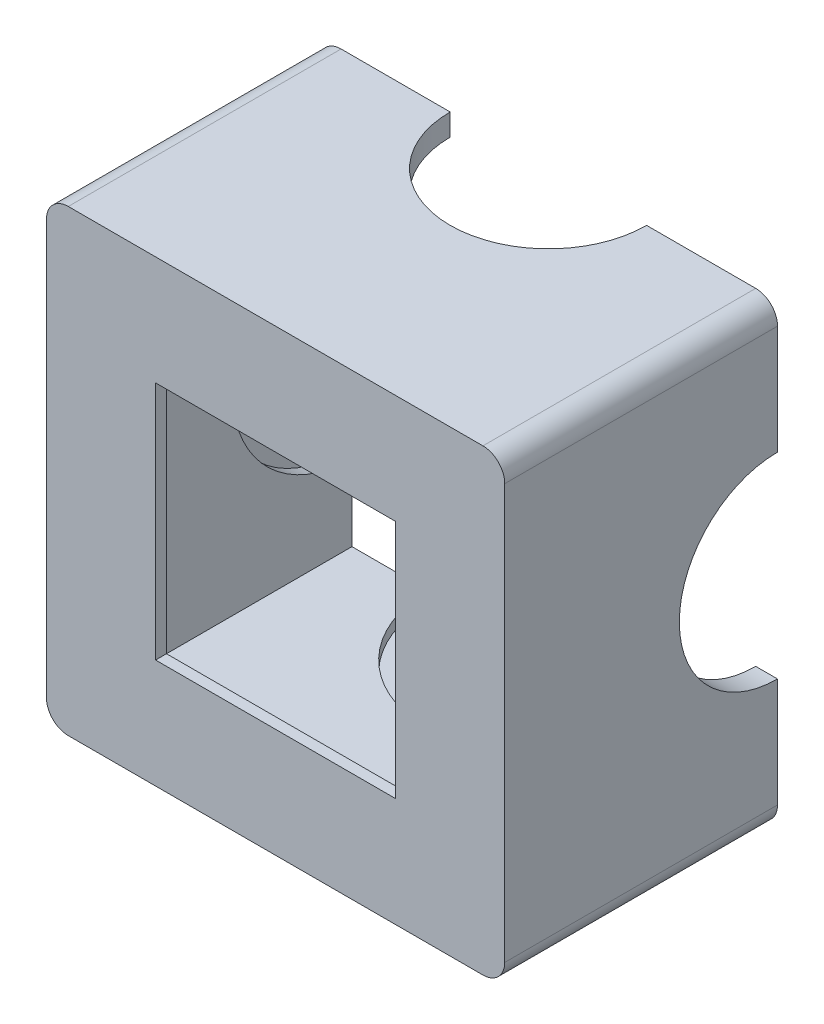
ISO-10303-21;
HEADER;
FILE_DESCRIPTION(('STEP AP214'),'2;1');
FILE_NAME('part.step','',(''),(''),'','','');
FILE_SCHEMA(('AUTOMOTIVE_DESIGN { 1 0 10303 214 1 1 1 1 }'));
ENDSEC;
DATA;
#1=APPLICATION_CONTEXT('core data for automotive mechanical design processes');
#2=APPLICATION_PROTOCOL_DEFINITION('international standard','automotive_design',2000,#1);
#3=PRODUCT_CONTEXT('',#1,'mechanical');
#4=PRODUCT('Part','Part','',(#3));
#5=PRODUCT_RELATED_PRODUCT_CATEGORY('part','',(#4));
#6=PRODUCT_DEFINITION_FORMATION('','',#4);
#7=PRODUCT_DEFINITION_CONTEXT('part definition',#1,'design');
#8=PRODUCT_DEFINITION('design','',#6,#7);
#9=PRODUCT_DEFINITION_SHAPE('','',#8);
#10=(LENGTH_UNIT() NAMED_UNIT(*) SI_UNIT(.MILLI.,.METRE.));
#11=(NAMED_UNIT(*) PLANE_ANGLE_UNIT() SI_UNIT($,.RADIAN.));
#12=(NAMED_UNIT(*) SI_UNIT($,.STERADIAN.) SOLID_ANGLE_UNIT());
#13=UNCERTAINTY_MEASURE_WITH_UNIT(LENGTH_MEASURE(1.E-05),#10,'distance_accuracy_value','');
#14=(GEOMETRIC_REPRESENTATION_CONTEXT(3) GLOBAL_UNCERTAINTY_ASSIGNED_CONTEXT((#13)) GLOBAL_UNIT_ASSIGNED_CONTEXT((#10,
#11,#12)) REPRESENTATION_CONTEXT('',''));
#15=CARTESIAN_POINT('',(0.,0.,0.));
#16=DIRECTION('',(0.,0.,1.));
#17=DIRECTION('',(1.,0.,0.));
#18=AXIS2_PLACEMENT_3D('',#15,#16,#17);
#19=CARTESIAN_POINT('',(0.,0.,0.));
#20=DIRECTION('',(0.,0.,1.));
#21=DIRECTION('',(1.,0.,0.));
#22=AXIS2_PLACEMENT_3D('',#19,#20,#21);
#23=PLANE('',#22);
#24=DIRECTION('',(0.,1.,0.));
#25=VECTOR('',#24,1.);
#26=CARTESIAN_POINT('',(21.,21.,0.));
#27=LINE('',#26,#25);
#28=CARTESIAN_POINT('',(21.,-19.,0.));
#29=VERTEX_POINT('',#28);
#30=CARTESIAN_POINT('',(21.,-9.,0.));
#31=VERTEX_POINT('',#30);
#32=EDGE_CURVE('E395',#29,#31,#27,.T.);
#33=ORIENTED_EDGE('',*,*,#32,.F.);
#34=CARTESIAN_POINT('',(19.,-19.,0.));
#35=DIRECTION('',(0.,0.,1.));
#36=DIRECTION('',(1.,0.,0.));
#37=AXIS2_PLACEMENT_3D('',#34,#35,#36);
#38=CIRCLE('',#37,2.);
#39=CARTESIAN_POINT('',(19.,-21.,0.));
#40=VERTEX_POINT('',#39);
#41=EDGE_CURVE('E559',#29,#40,#38,.F.);
#42=ORIENTED_EDGE('',*,*,#41,.T.);
#43=DIRECTION('',(1.,0.,0.));
#44=VECTOR('',#43,1.);
#45=CARTESIAN_POINT('',(-21.,-21.,0.));
#46=LINE('',#45,#44);
#47=CARTESIAN_POINT('',(9.00000000000022,-20.9999999999999,0.));
#48=VERTEX_POINT('',#47);
#49=EDGE_CURVE('E410',#48,#40,#46,.T.);
#50=ORIENTED_EDGE('',*,*,#49,.F.);
#51=DIRECTION('',(0.,1.,0.));
#52=VECTOR('',#51,1.);
#53=CARTESIAN_POINT('',(9.00000000000022,-20.9999999999999,0.));
#54=LINE('',#53,#52);
#55=CARTESIAN_POINT('',(9.0000000000002,-18.9999999999999,0.));
#56=VERTEX_POINT('',#55);
#57=EDGE_CURVE('E519',#48,#56,#54,.T.);
#58=ORIENTED_EDGE('',*,*,#57,.T.);
#59=DIRECTION('',(-1.,0.,0.));
#60=VECTOR('',#59,1.);
#61=CARTESIAN_POINT('',(2.01368703888599E-13,-19.,0.));
#62=LINE('',#61,#60);
#63=CARTESIAN_POINT('',(11.0000000000002,-18.9999999999999,0.));
#64=VERTEX_POINT('',#63);
#65=EDGE_CURVE('E510',#64,#56,#62,.T.);
#66=ORIENTED_EDGE('',*,*,#65,.F.);
#67=DIRECTION('',(0.,1.,0.));
#68=VECTOR('',#67,1.);
#69=CARTESIAN_POINT('',(11.0000000000002,-18.9999999999999,0.));
#70=LINE('',#69,#68);
#71=CARTESIAN_POINT('',(11.0000000000002,-17.9999999999999,0.));
#72=VERTEX_POINT('',#71);
#73=EDGE_CURVE('E499',#64,#72,#70,.T.);
#74=ORIENTED_EDGE('',*,*,#73,.T.);
#75=DIRECTION('',(1.,0.,0.));
#76=VECTOR('',#75,1.);
#77=CARTESIAN_POINT('',(-18.,-18.,0.));
#78=LINE('',#77,#76);
#79=CARTESIAN_POINT('',(18.,-18.,0.));
#80=VERTEX_POINT('',#79);
#81=EDGE_CURVE('E378',#72,#80,#78,.T.);
#82=ORIENTED_EDGE('',*,*,#81,.T.);
#83=DIRECTION('',(0.,1.,0.));
#84=VECTOR('',#83,1.);
#85=CARTESIAN_POINT('',(18.,18.,0.));
#86=LINE('',#85,#84);
#87=CARTESIAN_POINT('',(18.,-11.,0.));
#88=VERTEX_POINT('',#87);
#89=EDGE_CURVE('E364',#80,#88,#86,.T.);
#90=ORIENTED_EDGE('',*,*,#89,.T.);
#91=DIRECTION('',(-1.,0.,0.));
#92=VECTOR('',#91,1.);
#93=CARTESIAN_POINT('',(19.,-11.,0.));
#94=LINE('',#93,#92);
#95=CARTESIAN_POINT('',(19.,-11.,0.));
#96=VERTEX_POINT('',#95);
#97=EDGE_CURVE('E335',#88,#96,#94,.F.);
#98=ORIENTED_EDGE('',*,*,#97,.T.);
#99=DIRECTION('',(0.,-1.,0.));
#100=VECTOR('',#99,1.);
#101=CARTESIAN_POINT('',(19.,0.,0.));
#102=LINE('',#101,#100);
#103=CARTESIAN_POINT('',(19.,-9.,0.));
#104=VERTEX_POINT('',#103);
#105=EDGE_CURVE('E409',#104,#96,#102,.T.);
#106=ORIENTED_EDGE('',*,*,#105,.F.);
#107=DIRECTION('',(-1.,0.,0.));
#108=VECTOR('',#107,1.);
#109=CARTESIAN_POINT('',(21.,-9.,0.));
#110=LINE('',#109,#108);
#111=EDGE_CURVE('E322',#104,#31,#110,.F.);
#112=ORIENTED_EDGE('',*,*,#111,.T.);
#113=EDGE_LOOP('',(#33,#42,#50,#58,#66,#74,#82,#90,#98,#106,#112));
#114=FACE_BOUND('',#113,.T.);
#115=ADVANCED_FACE('F45',(#114),#23,.F.);
#116=CARTESIAN_POINT('',(2.22069774282232E-13,-21.,0.));
#117=DIRECTION('',(0.,1.,0.));
#118=DIRECTION('',(-1.,0.,0.));
#119=AXIS2_PLACEMENT_3D('',#116,#117,#118);
#120=CYLINDRICAL_SURFACE('',#119,9.);
#121=CARTESIAN_POINT('',(2.22069774282232E-13,-21.,0.));
#122=DIRECTION('',(0.,1.,0.));
#123=DIRECTION('',(-1.,0.,0.));
#124=AXIS2_PLACEMENT_3D('',#121,#122,#123);
#125=CIRCLE('',#124,9.);
#126=CARTESIAN_POINT('',(-8.99999999999978,-21.0000000000001,0.));
#127=VERTEX_POINT('',#126);
#128=EDGE_CURVE('E511',#127,#48,#125,.T.);
#129=ORIENTED_EDGE('',*,*,#128,.F.);
#130=DIRECTION('',(0.,1.,0.));
#131=VECTOR('',#130,1.);
#132=CARTESIAN_POINT('',(-8.99999999999978,-21.0000000000001,0.));
#133=LINE('',#132,#131);
#134=CARTESIAN_POINT('',(-8.9999999999998,-19.0000000000001,0.));
#135=VERTEX_POINT('',#134);
#136=EDGE_CURVE('E515',#135,#127,#133,.F.);
#137=ORIENTED_EDGE('',*,*,#136,.F.);
#138=CARTESIAN_POINT('',(2.00873068609748E-13,-19.,0.));
#139=DIRECTION('',(0.,1.,0.));
#140=DIRECTION('',(-1.,0.,0.));
#141=AXIS2_PLACEMENT_3D('',#138,#139,#140);
#142=CIRCLE('',#141,9.);
#143=EDGE_CURVE('E503',#135,#56,#142,.T.);
#144=ORIENTED_EDGE('',*,*,#143,.T.);
#145=ORIENTED_EDGE('',*,*,#57,.F.);
#146=EDGE_LOOP('',(#129,#137,#144,#145));
#147=FACE_BOUND('',#146,.T.);
#148=ADVANCED_FACE('F652',(#147),#120,.F.);
#149=CARTESIAN_POINT('',(2.00873068609748E-13,-19.,0.));
#150=DIRECTION('',(0.,1.,0.));
#151=DIRECTION('',(-1.,0.,0.));
#152=AXIS2_PLACEMENT_3D('',#149,#150,#151);
#153=PLANE('',#152);
#154=ORIENTED_EDGE('',*,*,#143,.F.);
#155=CARTESIAN_POINT('',(-10.9999999999998,-19.0000000000001,0.));
#156=VERTEX_POINT('',#155);
#157=EDGE_CURVE('E506',#135,#156,#62,.T.);
#158=ORIENTED_EDGE('',*,*,#157,.T.);
#159=CARTESIAN_POINT('',(2.00873068609748E-13,-19.,0.));
#160=DIRECTION('',(0.,1.,0.));
#161=DIRECTION('',(-1.,0.,0.));
#162=AXIS2_PLACEMENT_3D('',#159,#160,#161);
#163=CIRCLE('',#162,11.);
#164=EDGE_CURVE('E488',#156,#64,#163,.T.);
#165=ORIENTED_EDGE('',*,*,#164,.T.);
#166=ORIENTED_EDGE('',*,*,#65,.T.);
#167=EDGE_LOOP('',(#154,#158,#165,#166));
#168=FACE_BOUND('',#167,.T.);
#169=ADVANCED_FACE('F646',(#168),#153,.T.);
#170=CARTESIAN_POINT('',(2.00873068609748E-13,-19.,0.));
#171=DIRECTION('',(0.,1.,0.));
#172=DIRECTION('',(-1.,0.,0.));
#173=AXIS2_PLACEMENT_3D('',#170,#171,#172);
#174=CYLINDRICAL_SURFACE('',#173,11.);
#175=ORIENTED_EDGE('',*,*,#164,.F.);
#176=DIRECTION('',(0.,1.,0.));
#177=VECTOR('',#176,1.);
#178=CARTESIAN_POINT('',(-10.9999999999998,-19.0000000000001,0.));
#179=LINE('',#178,#177);
#180=CARTESIAN_POINT('',(-10.9999999999998,-18.0000000000001,0.));
#181=VERTEX_POINT('',#180);
#182=EDGE_CURVE('E491',#181,#156,#179,.F.);
#183=ORIENTED_EDGE('',*,*,#182,.F.);
#184=CARTESIAN_POINT('',(1.90274715773506E-13,-18.,0.));
#185=DIRECTION('',(0.,1.,0.));
#186=DIRECTION('',(-1.,0.,0.));
#187=AXIS2_PLACEMENT_3D('',#184,#185,#186);
#188=CIRCLE('',#187,11.);
#189=EDGE_CURVE('E495',#181,#72,#188,.T.);
#190=ORIENTED_EDGE('',*,*,#189,.T.);
#191=ORIENTED_EDGE('',*,*,#73,.F.);
#192=EDGE_LOOP('',(#175,#183,#190,#191));
#193=FACE_BOUND('',#192,.T.);
#194=ADVANCED_FACE('F660',(#193),#174,.F.);
#195=CARTESIAN_POINT('',(-19.,-21.,0.));
#196=VERTEX_POINT('',#195);
#197=EDGE_CURVE('E405',#196,#127,#46,.T.);
#198=ORIENTED_EDGE('',*,*,#197,.F.);
#199=CARTESIAN_POINT('',(-19.,-19.,0.));
#200=DIRECTION('',(0.,0.,1.));
#201=DIRECTION('',(1.,0.,0.));
#202=AXIS2_PLACEMENT_3D('',#199,#200,#201);
#203=CIRCLE('',#202,2.);
#204=CARTESIAN_POINT('',(-21.,-19.,0.));
#205=VERTEX_POINT('',#204);
#206=EDGE_CURVE('E530',#196,#205,#203,.F.);
#207=ORIENTED_EDGE('',*,*,#206,.T.);
#208=DIRECTION('',(0.,-1.,0.));
#209=VECTOR('',#208,1.);
#210=CARTESIAN_POINT('',(-21.,21.,0.));
#211=LINE('',#210,#209);
#212=CARTESIAN_POINT('',(-21.,-9.,0.));
#213=VERTEX_POINT('',#212);
#214=EDGE_CURVE('E406',#213,#205,#211,.T.);
#215=ORIENTED_EDGE('',*,*,#214,.F.);
#216=DIRECTION('',(1.,0.,0.));
#217=VECTOR('',#216,1.);
#218=CARTESIAN_POINT('',(-21.,-9.,0.));
#219=LINE('',#218,#217);
#220=CARTESIAN_POINT('',(-19.,-9.,0.));
#221=VERTEX_POINT('',#220);
#222=EDGE_CURVE('E484',#213,#221,#219,.T.);
#223=ORIENTED_EDGE('',*,*,#222,.T.);
#224=DIRECTION('',(0.,1.,0.));
#225=VECTOR('',#224,1.);
#226=CARTESIAN_POINT('',(-19.,0.,0.));
#227=LINE('',#226,#225);
#228=CARTESIAN_POINT('',(-19.,-11.,0.));
#229=VERTEX_POINT('',#228);
#230=EDGE_CURVE('E475',#229,#221,#227,.T.);
#231=ORIENTED_EDGE('',*,*,#230,.F.);
#232=DIRECTION('',(1.,0.,0.));
#233=VECTOR('',#232,1.);
#234=CARTESIAN_POINT('',(-19.,-11.,0.));
#235=LINE('',#234,#233);
#236=CARTESIAN_POINT('',(-18.,-11.,0.));
#237=VERTEX_POINT('',#236);
#238=EDGE_CURVE('E464',#229,#237,#235,.T.);
#239=ORIENTED_EDGE('',*,*,#238,.T.);
#240=DIRECTION('',(0.,-1.,0.));
#241=VECTOR('',#240,1.);
#242=CARTESIAN_POINT('',(-18.,18.,0.));
#243=LINE('',#242,#241);
#244=CARTESIAN_POINT('',(-18.,-18.,0.));
#245=VERTEX_POINT('',#244);
#246=EDGE_CURVE('E375',#237,#245,#243,.T.);
#247=ORIENTED_EDGE('',*,*,#246,.T.);
#248=EDGE_CURVE('E351',#245,#181,#78,.T.);
#249=ORIENTED_EDGE('',*,*,#248,.T.);
#250=ORIENTED_EDGE('',*,*,#182,.T.);
#251=ORIENTED_EDGE('',*,*,#157,.F.);
#252=ORIENTED_EDGE('',*,*,#136,.T.);
#253=EDGE_LOOP('',(#198,#207,#215,#223,#231,#239,#247,#249,#250,#251,#252));
#254=FACE_BOUND('',#253,.T.);
#255=ADVANCED_FACE('F655',(#254),#23,.F.);
#256=CARTESIAN_POINT('',(-21.,0.,0.));
#257=DIRECTION('',(1.,0.,0.));
#258=DIRECTION('',(0.,1.,0.));
#259=AXIS2_PLACEMENT_3D('',#256,#257,#258);
#260=CYLINDRICAL_SURFACE('',#259,9.);
#261=CARTESIAN_POINT('',(-21.,0.,0.));
#262=DIRECTION('',(1.,0.,0.));
#263=DIRECTION('',(0.,1.,0.));
#264=AXIS2_PLACEMENT_3D('',#261,#262,#263);
#265=CIRCLE('',#264,9.);
#266=CARTESIAN_POINT('',(-21.,9.,0.));
#267=VERTEX_POINT('',#266);
#268=EDGE_CURVE('E476',#267,#213,#265,.T.);
#269=ORIENTED_EDGE('',*,*,#268,.F.);
#270=DIRECTION('',(1.,0.,0.));
#271=VECTOR('',#270,1.);
#272=CARTESIAN_POINT('',(-21.,9.,0.));
#273=LINE('',#272,#271);
#274=CARTESIAN_POINT('',(-19.,9.,0.));
#275=VERTEX_POINT('',#274);
#276=EDGE_CURVE('E480',#275,#267,#273,.F.);
#277=ORIENTED_EDGE('',*,*,#276,.F.);
#278=CARTESIAN_POINT('',(-19.,0.,0.));
#279=DIRECTION('',(1.,0.,0.));
#280=DIRECTION('',(0.,1.,0.));
#281=AXIS2_PLACEMENT_3D('',#278,#279,#280);
#282=CIRCLE('',#281,9.);
#283=EDGE_CURVE('E468',#275,#221,#282,.T.);
#284=ORIENTED_EDGE('',*,*,#283,.T.);
#285=ORIENTED_EDGE('',*,*,#222,.F.);
#286=EDGE_LOOP('',(#269,#277,#284,#285));
#287=FACE_BOUND('',#286,.T.);
#288=ADVANCED_FACE('F690',(#287),#260,.F.);
#289=CARTESIAN_POINT('',(-19.,0.,0.));
#290=DIRECTION('',(1.,0.,0.));
#291=DIRECTION('',(0.,1.,0.));
#292=AXIS2_PLACEMENT_3D('',#289,#290,#291);
#293=PLANE('',#292);
#294=ORIENTED_EDGE('',*,*,#283,.F.);
#295=CARTESIAN_POINT('',(-19.,11.,0.));
#296=VERTEX_POINT('',#295);
#297=EDGE_CURVE('E471',#275,#296,#227,.T.);
#298=ORIENTED_EDGE('',*,*,#297,.T.);
#299=CARTESIAN_POINT('',(-19.,0.,0.));
#300=DIRECTION('',(1.,0.,0.));
#301=DIRECTION('',(0.,1.,0.));
#302=AXIS2_PLACEMENT_3D('',#299,#300,#301);
#303=CIRCLE('',#302,11.);
#304=EDGE_CURVE('E453',#296,#229,#303,.T.);
#305=ORIENTED_EDGE('',*,*,#304,.T.);
#306=ORIENTED_EDGE('',*,*,#230,.T.);
#307=EDGE_LOOP('',(#294,#298,#305,#306));
#308=FACE_BOUND('',#307,.T.);
#309=ADVANCED_FACE('F694',(#308),#293,.T.);
#310=CARTESIAN_POINT('',(-19.,0.,0.));
#311=DIRECTION('',(1.,0.,0.));
#312=DIRECTION('',(0.,1.,0.));
#313=AXIS2_PLACEMENT_3D('',#310,#311,#312);
#314=CYLINDRICAL_SURFACE('',#313,11.);
#315=ORIENTED_EDGE('',*,*,#304,.F.);
#316=DIRECTION('',(1.,0.,0.));
#317=VECTOR('',#316,1.);
#318=CARTESIAN_POINT('',(-19.,11.,0.));
#319=LINE('',#318,#317);
#320=CARTESIAN_POINT('',(-18.,11.,0.));
#321=VERTEX_POINT('',#320);
#322=EDGE_CURVE('E456',#321,#296,#319,.F.);
#323=ORIENTED_EDGE('',*,*,#322,.F.);
#324=CARTESIAN_POINT('',(-18.,0.,0.));
#325=DIRECTION('',(1.,0.,0.));
#326=DIRECTION('',(0.,1.,0.));
#327=AXIS2_PLACEMENT_3D('',#324,#325,#326);
#328=CIRCLE('',#327,11.);
#329=EDGE_CURVE('E460',#321,#237,#328,.T.);
#330=ORIENTED_EDGE('',*,*,#329,.T.);
#331=ORIENTED_EDGE('',*,*,#238,.F.);
#332=EDGE_LOOP('',(#315,#323,#330,#331));
#333=FACE_BOUND('',#332,.T.);
#334=ADVANCED_FACE('F697',(#333),#314,.F.);
#335=CARTESIAN_POINT('',(-21.,19.,0.));
#336=VERTEX_POINT('',#335);
#337=EDGE_CURVE('E401',#336,#267,#211,.T.);
#338=ORIENTED_EDGE('',*,*,#337,.F.);
#339=CARTESIAN_POINT('',(-19.,19.,0.));
#340=DIRECTION('',(0.,0.,1.));
#341=DIRECTION('',(1.,0.,0.));
#342=AXIS2_PLACEMENT_3D('',#339,#340,#341);
#343=CIRCLE('',#342,2.);
#344=CARTESIAN_POINT('',(-19.,21.,0.));
#345=VERTEX_POINT('',#344);
#346=EDGE_CURVE('E11',#336,#345,#343,.F.);
#347=ORIENTED_EDGE('',*,*,#346,.T.);
#348=DIRECTION('',(-1.,0.,0.));
#349=VECTOR('',#348,1.);
#350=CARTESIAN_POINT('',(-21.,21.,0.));
#351=LINE('',#350,#349);
#352=CARTESIAN_POINT('',(-9.00000000000007,21.,0.));
#353=VERTEX_POINT('',#352);
#354=EDGE_CURVE('E402',#353,#345,#351,.T.);
#355=ORIENTED_EDGE('',*,*,#354,.F.);
#356=DIRECTION('',(0.,-1.,0.));
#357=VECTOR('',#356,1.);
#358=CARTESIAN_POINT('',(-9.00000000000007,21.,0.));
#359=LINE('',#358,#357);
#360=CARTESIAN_POINT('',(-9.00000000000007,19.,0.));
#361=VERTEX_POINT('',#360);
#362=EDGE_CURVE('E449',#353,#361,#359,.T.);
#363=ORIENTED_EDGE('',*,*,#362,.T.);
#364=DIRECTION('',(1.,0.,0.));
#365=VECTOR('',#364,1.);
#366=CARTESIAN_POINT('',(0.,19.,0.));
#367=LINE('',#366,#365);
#368=CARTESIAN_POINT('',(-11.0000000000001,19.,0.));
#369=VERTEX_POINT('',#368);
#370=EDGE_CURVE('E440',#369,#361,#367,.T.);
#371=ORIENTED_EDGE('',*,*,#370,.F.);
#372=DIRECTION('',(0.,-1.,0.));
#373=VECTOR('',#372,1.);
#374=CARTESIAN_POINT('',(-11.0000000000001,19.,0.));
#375=LINE('',#374,#373);
#376=CARTESIAN_POINT('',(-11.0000000000001,18.,0.));
#377=VERTEX_POINT('',#376);
#378=EDGE_CURVE('E429',#369,#377,#375,.T.);
#379=ORIENTED_EDGE('',*,*,#378,.T.);
#380=DIRECTION('',(-1.,0.,0.));
#381=VECTOR('',#380,1.);
#382=CARTESIAN_POINT('',(-18.,18.,0.));
#383=LINE('',#382,#381);
#384=CARTESIAN_POINT('',(-18.,18.,0.));
#385=VERTEX_POINT('',#384);
#386=EDGE_CURVE('E372',#377,#385,#383,.T.);
#387=ORIENTED_EDGE('',*,*,#386,.T.);
#388=EDGE_CURVE('E371',#385,#321,#243,.T.);
#389=ORIENTED_EDGE('',*,*,#388,.T.);
#390=ORIENTED_EDGE('',*,*,#322,.T.);
#391=ORIENTED_EDGE('',*,*,#297,.F.);
#392=ORIENTED_EDGE('',*,*,#276,.T.);
#393=EDGE_LOOP('',(#338,#347,#355,#363,#371,#379,#387,#389,#390,#391,#392));
#394=FACE_BOUND('',#393,.T.);
#395=ADVANCED_FACE('F684',(#394),#23,.F.);
#396=CARTESIAN_POINT('',(0.,21.,0.));
#397=DIRECTION('',(0.,-1.,0.));
#398=DIRECTION('',(1.,0.,0.));
#399=AXIS2_PLACEMENT_3D('',#396,#397,#398);
#400=CYLINDRICAL_SURFACE('',#399,9.);
#401=CARTESIAN_POINT('',(0.,21.,0.));
#402=DIRECTION('',(0.,-1.,0.));
#403=DIRECTION('',(1.,0.,0.));
#404=AXIS2_PLACEMENT_3D('',#401,#402,#403);
#405=CIRCLE('',#404,9.);
#406=CARTESIAN_POINT('',(8.99999999999993,21.,0.));
#407=VERTEX_POINT('',#406);
#408=EDGE_CURVE('E441',#407,#353,#405,.T.);
#409=ORIENTED_EDGE('',*,*,#408,.F.);
#410=DIRECTION('',(0.,-1.,0.));
#411=VECTOR('',#410,1.);
#412=CARTESIAN_POINT('',(8.99999999999993,21.,0.));
#413=LINE('',#412,#411);
#414=CARTESIAN_POINT('',(8.99999999999993,19.,0.));
#415=VERTEX_POINT('',#414);
#416=EDGE_CURVE('E445',#415,#407,#413,.F.);
#417=ORIENTED_EDGE('',*,*,#416,.F.);
#418=CARTESIAN_POINT('',(0.,19.,0.));
#419=DIRECTION('',(0.,-1.,0.));
#420=DIRECTION('',(1.,0.,0.));
#421=AXIS2_PLACEMENT_3D('',#418,#419,#420);
#422=CIRCLE('',#421,9.);
#423=EDGE_CURVE('E433',#415,#361,#422,.T.);
#424=ORIENTED_EDGE('',*,*,#423,.T.);
#425=ORIENTED_EDGE('',*,*,#362,.F.);
#426=EDGE_LOOP('',(#409,#417,#424,#425));
#427=FACE_BOUND('',#426,.T.);
#428=ADVANCED_FACE('F681',(#427),#400,.F.);
#429=CARTESIAN_POINT('',(0.,19.,0.));
#430=DIRECTION('',(0.,-1.,0.));
#431=DIRECTION('',(1.,0.,0.));
#432=AXIS2_PLACEMENT_3D('',#429,#430,#431);
#433=PLANE('',#432);
#434=ORIENTED_EDGE('',*,*,#423,.F.);
#435=CARTESIAN_POINT('',(10.9999999999999,19.,0.));
#436=VERTEX_POINT('',#435);
#437=EDGE_CURVE('E436',#415,#436,#367,.T.);
#438=ORIENTED_EDGE('',*,*,#437,.T.);
#439=CARTESIAN_POINT('',(0.,19.,0.));
#440=DIRECTION('',(0.,-1.,0.));
#441=DIRECTION('',(1.,0.,0.));
#442=AXIS2_PLACEMENT_3D('',#439,#440,#441);
#443=CIRCLE('',#442,11.);
#444=EDGE_CURVE('E418',#436,#369,#443,.T.);
#445=ORIENTED_EDGE('',*,*,#444,.T.);
#446=ORIENTED_EDGE('',*,*,#370,.T.);
#447=EDGE_LOOP('',(#434,#438,#445,#446));
#448=FACE_BOUND('',#447,.T.);
#449=ADVANCED_FACE('F677',(#448),#433,.T.);
#450=CARTESIAN_POINT('',(0.,19.,0.));
#451=DIRECTION('',(0.,-1.,0.));
#452=DIRECTION('',(1.,0.,0.));
#453=AXIS2_PLACEMENT_3D('',#450,#451,#452);
#454=CYLINDRICAL_SURFACE('',#453,11.);
#455=ORIENTED_EDGE('',*,*,#444,.F.);
#456=DIRECTION('',(0.,-1.,0.));
#457=VECTOR('',#456,1.);
#458=CARTESIAN_POINT('',(10.9999999999999,19.,0.));
#459=LINE('',#458,#457);
#460=CARTESIAN_POINT('',(10.9999999999999,18.,0.));
#461=VERTEX_POINT('',#460);
#462=EDGE_CURVE('E421',#461,#436,#459,.F.);
#463=ORIENTED_EDGE('',*,*,#462,.F.);
#464=CARTESIAN_POINT('',(0.,18.,0.));
#465=DIRECTION('',(0.,-1.,0.));
#466=DIRECTION('',(1.,0.,0.));
#467=AXIS2_PLACEMENT_3D('',#464,#465,#466);
#468=CIRCLE('',#467,11.);
#469=EDGE_CURVE('E425',#461,#377,#468,.T.);
#470=ORIENTED_EDGE('',*,*,#469,.T.);
#471=ORIENTED_EDGE('',*,*,#378,.F.);
#472=EDGE_LOOP('',(#455,#463,#470,#471));
#473=FACE_BOUND('',#472,.T.);
#474=ADVANCED_FACE('F673',(#473),#454,.F.);
#475=CARTESIAN_POINT('',(19.,21.,0.));
#476=VERTEX_POINT('',#475);
#477=EDGE_CURVE('E398',#476,#407,#351,.T.);
#478=ORIENTED_EDGE('',*,*,#477,.F.);
#479=CARTESIAN_POINT('',(19.,19.,0.));
#480=DIRECTION('',(0.,0.,1.));
#481=DIRECTION('',(1.,0.,0.));
#482=AXIS2_PLACEMENT_3D('',#479,#480,#481);
#483=CIRCLE('',#482,2.);
#484=CARTESIAN_POINT('',(21.,19.,0.));
#485=VERTEX_POINT('',#484);
#486=EDGE_CURVE('E54',#476,#485,#483,.F.);
#487=ORIENTED_EDGE('',*,*,#486,.T.);
#488=CARTESIAN_POINT('',(21.,9.,0.));
#489=VERTEX_POINT('',#488);
#490=EDGE_CURVE('E394',#489,#485,#27,.T.);
#491=ORIENTED_EDGE('',*,*,#490,.F.);
#492=DIRECTION('',(-1.,0.,0.));
#493=VECTOR('',#492,1.);
#494=CARTESIAN_POINT('',(21.,9.,0.));
#495=LINE('',#494,#493);
#496=CARTESIAN_POINT('',(19.,9.,0.));
#497=VERTEX_POINT('',#496);
#498=EDGE_CURVE('E326',#489,#497,#495,.T.);
#499=ORIENTED_EDGE('',*,*,#498,.T.);
#500=CARTESIAN_POINT('',(19.,11.,0.));
#501=VERTEX_POINT('',#500);
#502=EDGE_CURVE('E411',#501,#497,#102,.T.);
#503=ORIENTED_EDGE('',*,*,#502,.F.);
#504=DIRECTION('',(-1.,0.,0.));
#505=VECTOR('',#504,1.);
#506=CARTESIAN_POINT('',(19.,11.,0.));
#507=LINE('',#506,#505);
#508=CARTESIAN_POINT('',(18.,11.,0.));
#509=VERTEX_POINT('',#508);
#510=EDGE_CURVE('E341',#501,#509,#507,.T.);
#511=ORIENTED_EDGE('',*,*,#510,.T.);
#512=CARTESIAN_POINT('',(18.,18.,0.));
#513=VERTEX_POINT('',#512);
#514=EDGE_CURVE('E345',#509,#513,#86,.T.);
#515=ORIENTED_EDGE('',*,*,#514,.T.);
#516=EDGE_CURVE('E368',#513,#461,#383,.T.);
#517=ORIENTED_EDGE('',*,*,#516,.T.);
#518=ORIENTED_EDGE('',*,*,#462,.T.);
#519=ORIENTED_EDGE('',*,*,#437,.F.);
#520=ORIENTED_EDGE('',*,*,#416,.T.);
#521=EDGE_LOOP('',(#478,#487,#491,#499,#503,#511,#515,#517,#518,#519,#520));
#522=FACE_BOUND('',#521,.T.);
#523=ADVANCED_FACE('F573',(#522),#23,.F.);
#524=CARTESIAN_POINT('',(21.,21.,24.));
#525=DIRECTION('',(-1.,0.,0.));
#526=DIRECTION('',(0.,-1.,0.));
#527=AXIS2_PLACEMENT_3D('',#524,#525,#526);
#528=PLANE('',#527);
#529=DIRECTION('',(0.,1.,0.));
#530=VECTOR('',#529,1.);
#531=CARTESIAN_POINT('',(21.,21.,25.));
#532=LINE('',#531,#530);
#533=CARTESIAN_POINT('',(21.,-19.,25.));
#534=VERTEX_POINT('',#533);
#535=CARTESIAN_POINT('',(21.,19.,25.));
#536=VERTEX_POINT('',#535);
#537=EDGE_CURVE('E302',#534,#536,#532,.T.);
#538=ORIENTED_EDGE('',*,*,#537,.F.);
#539=DIRECTION('',(0.,0.,-1.));
#540=VECTOR('',#539,1.);
#541=CARTESIAN_POINT('',(21.,-19.,24.));
#542=LINE('',#541,#540);
#543=EDGE_CURVE('E555',#534,#29,#542,.T.);
#544=ORIENTED_EDGE('',*,*,#543,.T.);
#545=ORIENTED_EDGE('',*,*,#32,.T.);
#546=CARTESIAN_POINT('',(21.,0.,0.));
#547=DIRECTION('',(-1.,0.,0.));
#548=DIRECTION('',(0.,-1.,0.));
#549=AXIS2_PLACEMENT_3D('',#546,#547,#548);
#550=CIRCLE('',#549,9.);
#551=EDGE_CURVE('E318',#31,#489,#550,.T.);
#552=ORIENTED_EDGE('',*,*,#551,.T.);
#553=ORIENTED_EDGE('',*,*,#490,.T.);
#554=DIRECTION('',(0.,0.,-1.));
#555=VECTOR('',#554,1.);
#556=CARTESIAN_POINT('',(21.,19.,24.));
#557=LINE('',#556,#555);
#558=EDGE_CURVE('E552',#485,#536,#557,.F.);
#559=ORIENTED_EDGE('',*,*,#558,.T.);
#560=EDGE_LOOP('',(#538,#544,#545,#552,#553,#559));
#561=FACE_BOUND('',#560,.T.);
#562=ADVANCED_FACE('F579',(#561),#528,.F.);
#563=CARTESIAN_POINT('',(-21.,21.,24.));
#564=DIRECTION('',(0.,-1.,0.));
#565=DIRECTION('',(0.,0.,-1.));
#566=AXIS2_PLACEMENT_3D('',#563,#564,#565);
#567=PLANE('',#566);
#568=DIRECTION('',(-1.,0.,0.));
#569=VECTOR('',#568,1.);
#570=CARTESIAN_POINT('',(-21.,21.,25.));
#571=LINE('',#570,#569);
#572=CARTESIAN_POINT('',(19.,21.,25.));
#573=VERTEX_POINT('',#572);
#574=CARTESIAN_POINT('',(-19.,21.,25.));
#575=VERTEX_POINT('',#574);
#576=EDGE_CURVE('E306',#573,#575,#571,.T.);
#577=ORIENTED_EDGE('',*,*,#576,.F.);
#578=DIRECTION('',(0.,0.,-1.));
#579=VECTOR('',#578,1.);
#580=CARTESIAN_POINT('',(19.,21.,24.));
#581=LINE('',#580,#579);
#582=EDGE_CURVE('E565',#573,#476,#581,.T.);
#583=ORIENTED_EDGE('',*,*,#582,.T.);
#584=ORIENTED_EDGE('',*,*,#477,.T.);
#585=ORIENTED_EDGE('',*,*,#408,.T.);
#586=ORIENTED_EDGE('',*,*,#354,.T.);
#587=DIRECTION('',(0.,0.,-1.));
#588=VECTOR('',#587,1.);
#589=CARTESIAN_POINT('',(-19.,21.,24.));
#590=LINE('',#589,#588);
#591=EDGE_CURVE('E562',#345,#575,#590,.F.);
#592=ORIENTED_EDGE('',*,*,#591,.T.);
#593=EDGE_LOOP('',(#577,#583,#584,#585,#586,#592));
#594=FACE_BOUND('',#593,.T.);
#595=ADVANCED_FACE('F587',(#594),#567,.F.);
#596=CARTESIAN_POINT('',(-21.,21.,24.));
#597=DIRECTION('',(1.,0.,0.));
#598=DIRECTION('',(0.,1.,0.));
#599=AXIS2_PLACEMENT_3D('',#596,#597,#598);
#600=PLANE('',#599);
#601=ORIENTED_EDGE('',*,*,#214,.T.);
#602=DIRECTION('',(0.,0.,-1.));
#603=VECTOR('',#602,1.);
#604=CARTESIAN_POINT('',(-21.,-19.,24.));
#605=LINE('',#604,#603);
#606=CARTESIAN_POINT('',(-21.,-19.,25.));
#607=VERTEX_POINT('',#606);
#608=EDGE_CURVE('E537',#205,#607,#605,.F.);
#609=ORIENTED_EDGE('',*,*,#608,.T.);
#610=DIRECTION('',(0.,-1.,0.));
#611=VECTOR('',#610,1.);
#612=CARTESIAN_POINT('',(-21.,21.,25.));
#613=LINE('',#612,#611);
#614=CARTESIAN_POINT('',(-21.,19.,25.));
#615=VERTEX_POINT('',#614);
#616=EDGE_CURVE('E310',#615,#607,#613,.T.);
#617=ORIENTED_EDGE('',*,*,#616,.F.);
#618=DIRECTION('',(0.,0.,-1.));
#619=VECTOR('',#618,1.);
#620=CARTESIAN_POINT('',(-21.,19.,24.));
#621=LINE('',#620,#619);
#622=EDGE_CURVE('E533',#615,#336,#621,.T.);
#623=ORIENTED_EDGE('',*,*,#622,.T.);
#624=ORIENTED_EDGE('',*,*,#337,.T.);
#625=ORIENTED_EDGE('',*,*,#268,.T.);
#626=EDGE_LOOP('',(#601,#609,#617,#623,#624,#625));
#627=FACE_BOUND('',#626,.T.);
#628=ADVANCED_FACE('F596',(#627),#600,.F.);
#629=CARTESIAN_POINT('',(-21.,-21.,24.));
#630=DIRECTION('',(0.,1.,0.));
#631=DIRECTION('',(0.,0.,1.));
#632=AXIS2_PLACEMENT_3D('',#629,#630,#631);
#633=PLANE('',#632);
#634=DIRECTION('',(1.,0.,0.));
#635=VECTOR('',#634,1.);
#636=CARTESIAN_POINT('',(-21.,-21.,25.));
#637=LINE('',#636,#635);
#638=CARTESIAN_POINT('',(-19.,-21.,25.));
#639=VERTEX_POINT('',#638);
#640=CARTESIAN_POINT('',(19.,-21.,25.));
#641=VERTEX_POINT('',#640);
#642=EDGE_CURVE('E314',#639,#641,#637,.T.);
#643=ORIENTED_EDGE('',*,*,#642,.F.);
#644=DIRECTION('',(0.,0.,-1.));
#645=VECTOR('',#644,1.);
#646=CARTESIAN_POINT('',(-19.,-21.,24.));
#647=LINE('',#646,#645);
#648=EDGE_CURVE('E526',#639,#196,#647,.T.);
#649=ORIENTED_EDGE('',*,*,#648,.T.);
#650=ORIENTED_EDGE('',*,*,#197,.T.);
#651=ORIENTED_EDGE('',*,*,#128,.T.);
#652=ORIENTED_EDGE('',*,*,#49,.T.);
#653=DIRECTION('',(0.,0.,-1.));
#654=VECTOR('',#653,1.);
#655=CARTESIAN_POINT('',(19.,-21.,24.));
#656=LINE('',#655,#654);
#657=EDGE_CURVE('E523',#40,#641,#656,.F.);
#658=ORIENTED_EDGE('',*,*,#657,.T.);
#659=EDGE_LOOP('',(#643,#649,#650,#651,#652,#658));
#660=FACE_BOUND('',#659,.T.);
#661=ADVANCED_FACE('F605',(#660),#633,.F.);
#662=CARTESIAN_POINT('',(18.,18.,24.));
#663=DIRECTION('',(-1.,0.,0.));
#664=DIRECTION('',(0.,-1.,0.));
#665=AXIS2_PLACEMENT_3D('',#662,#663,#664);
#666=PLANE('',#665);
#667=CARTESIAN_POINT('',(18.,0.,0.));
#668=DIRECTION('',(-1.,0.,0.));
#669=DIRECTION('',(0.,-1.,0.));
#670=AXIS2_PLACEMENT_3D('',#667,#668,#669);
#671=CIRCLE('',#670,11.);
#672=EDGE_CURVE('E330',#88,#509,#671,.T.);
#673=ORIENTED_EDGE('',*,*,#672,.F.);
#674=ORIENTED_EDGE('',*,*,#89,.F.);
#675=DIRECTION('',(0.,0.,-1.));
#676=VECTOR('',#675,1.);
#677=CARTESIAN_POINT('',(18.,-18.,24.));
#678=LINE('',#677,#676);
#679=CARTESIAN_POINT('',(18.,-18.,24.));
#680=VERTEX_POINT('',#679);
#681=EDGE_CURVE('E363',#680,#80,#678,.T.);
#682=ORIENTED_EDGE('',*,*,#681,.F.);
#683=DIRECTION('',(0.,1.,0.));
#684=VECTOR('',#683,1.);
#685=CARTESIAN_POINT('',(18.,18.,24.));
#686=LINE('',#685,#684);
#687=CARTESIAN_POINT('',(18.,18.,24.));
#688=VERTEX_POINT('',#687);
#689=EDGE_CURVE('E346',#680,#688,#686,.T.);
#690=ORIENTED_EDGE('',*,*,#689,.T.);
#691=DIRECTION('',(0.,0.,-1.));
#692=VECTOR('',#691,1.);
#693=CARTESIAN_POINT('',(18.,18.,24.));
#694=LINE('',#693,#692);
#695=EDGE_CURVE('E390',#688,#513,#694,.T.);
#696=ORIENTED_EDGE('',*,*,#695,.T.);
#697=ORIENTED_EDGE('',*,*,#514,.F.);
#698=EDGE_LOOP('',(#673,#674,#682,#690,#696,#697));
#699=FACE_BOUND('',#698,.T.);
#700=ADVANCED_FACE('F627',(#699),#666,.T.);
#701=CARTESIAN_POINT('',(-18.,18.,24.));
#702=DIRECTION('',(0.,-1.,0.));
#703=DIRECTION('',(0.,0.,-1.));
#704=AXIS2_PLACEMENT_3D('',#701,#702,#703);
#705=PLANE('',#704);
#706=ORIENTED_EDGE('',*,*,#516,.F.);
#707=ORIENTED_EDGE('',*,*,#695,.F.);
#708=DIRECTION('',(-1.,0.,0.));
#709=VECTOR('',#708,1.);
#710=CARTESIAN_POINT('',(-18.,18.,24.));
#711=LINE('',#710,#709);
#712=CARTESIAN_POINT('',(-18.,18.,24.));
#713=VERTEX_POINT('',#712);
#714=EDGE_CURVE('E350',#688,#713,#711,.T.);
#715=ORIENTED_EDGE('',*,*,#714,.T.);
#716=DIRECTION('',(0.,0.,-1.));
#717=VECTOR('',#716,1.);
#718=CARTESIAN_POINT('',(-18.,18.,24.));
#719=LINE('',#718,#717);
#720=EDGE_CURVE('E386',#713,#385,#719,.T.);
#721=ORIENTED_EDGE('',*,*,#720,.T.);
#722=ORIENTED_EDGE('',*,*,#386,.F.);
#723=ORIENTED_EDGE('',*,*,#469,.F.);
#724=EDGE_LOOP('',(#706,#707,#715,#721,#722,#723));
#725=FACE_BOUND('',#724,.T.);
#726=ADVANCED_FACE('F667',(#725),#705,.T.);
#727=CARTESIAN_POINT('',(-18.,18.,24.));
#728=DIRECTION('',(1.,0.,0.));
#729=DIRECTION('',(0.,1.,0.));
#730=AXIS2_PLACEMENT_3D('',#727,#728,#729);
#731=PLANE('',#730);
#732=ORIENTED_EDGE('',*,*,#388,.F.);
#733=ORIENTED_EDGE('',*,*,#720,.F.);
#734=DIRECTION('',(0.,-1.,0.));
#735=VECTOR('',#734,1.);
#736=CARTESIAN_POINT('',(-18.,18.,24.));
#737=LINE('',#736,#735);
#738=CARTESIAN_POINT('',(-18.,-18.,24.));
#739=VERTEX_POINT('',#738);
#740=EDGE_CURVE('E355',#713,#739,#737,.T.);
#741=ORIENTED_EDGE('',*,*,#740,.T.);
#742=DIRECTION('',(0.,0.,-1.));
#743=VECTOR('',#742,1.);
#744=CARTESIAN_POINT('',(-18.,-18.,24.));
#745=LINE('',#744,#743);
#746=EDGE_CURVE('E382',#739,#245,#745,.T.);
#747=ORIENTED_EDGE('',*,*,#746,.T.);
#748=ORIENTED_EDGE('',*,*,#246,.F.);
#749=ORIENTED_EDGE('',*,*,#329,.F.);
#750=EDGE_LOOP('',(#732,#733,#741,#747,#748,#749));
#751=FACE_BOUND('',#750,.T.);
#752=ADVANCED_FACE('F701',(#751),#731,.T.);
#753=CARTESIAN_POINT('',(-18.,-18.,24.));
#754=DIRECTION('',(0.,1.,0.));
#755=DIRECTION('',(0.,0.,1.));
#756=AXIS2_PLACEMENT_3D('',#753,#754,#755);
#757=PLANE('',#756);
#758=ORIENTED_EDGE('',*,*,#248,.F.);
#759=ORIENTED_EDGE('',*,*,#746,.F.);
#760=DIRECTION('',(1.,0.,0.));
#761=VECTOR('',#760,1.);
#762=CARTESIAN_POINT('',(-18.,-18.,24.));
#763=LINE('',#762,#761);
#764=EDGE_CURVE('E359',#739,#680,#763,.T.);
#765=ORIENTED_EDGE('',*,*,#764,.T.);
#766=ORIENTED_EDGE('',*,*,#681,.T.);
#767=ORIENTED_EDGE('',*,*,#81,.F.);
#768=ORIENTED_EDGE('',*,*,#189,.F.);
#769=EDGE_LOOP('',(#758,#759,#765,#766,#767,#768));
#770=FACE_BOUND('',#769,.T.);
#771=ADVANCED_FACE('F662',(#770),#757,.T.);
#772=CARTESIAN_POINT('',(19.,0.,0.));
#773=DIRECTION('',(-1.,0.,0.));
#774=DIRECTION('',(0.,-1.,0.));
#775=AXIS2_PLACEMENT_3D('',#772,#773,#774);
#776=PLANE('',#775);
#777=CARTESIAN_POINT('',(19.,0.,0.));
#778=DIRECTION('',(-1.,0.,0.));
#779=DIRECTION('',(0.,-1.,0.));
#780=AXIS2_PLACEMENT_3D('',#777,#778,#779);
#781=CIRCLE('',#780,9.);
#782=EDGE_CURVE('E415',#104,#497,#781,.T.);
#783=ORIENTED_EDGE('',*,*,#782,.F.);
#784=ORIENTED_EDGE('',*,*,#105,.T.);
#785=CARTESIAN_POINT('',(19.,0.,0.));
#786=DIRECTION('',(-1.,0.,0.));
#787=DIRECTION('',(0.,-1.,0.));
#788=AXIS2_PLACEMENT_3D('',#785,#786,#787);
#789=CIRCLE('',#788,11.);
#790=EDGE_CURVE('E331',#96,#501,#789,.T.);
#791=ORIENTED_EDGE('',*,*,#790,.T.);
#792=ORIENTED_EDGE('',*,*,#502,.T.);
#793=EDGE_LOOP('',(#783,#784,#791,#792));
#794=FACE_BOUND('',#793,.T.);
#795=ADVANCED_FACE('F619',(#794),#776,.T.);
#796=CARTESIAN_POINT('',(19.,0.,0.));
#797=DIRECTION('',(-1.,0.,0.));
#798=DIRECTION('',(0.,-1.,0.));
#799=AXIS2_PLACEMENT_3D('',#796,#797,#798);
#800=CYLINDRICAL_SURFACE('',#799,11.);
#801=ORIENTED_EDGE('',*,*,#790,.F.);
#802=ORIENTED_EDGE('',*,*,#97,.F.);
#803=ORIENTED_EDGE('',*,*,#672,.T.);
#804=ORIENTED_EDGE('',*,*,#510,.F.);
#805=EDGE_LOOP('',(#801,#802,#803,#804));
#806=FACE_BOUND('',#805,.T.);
#807=ADVANCED_FACE('F712',(#806),#800,.F.);
#808=CARTESIAN_POINT('',(21.,0.,0.));
#809=DIRECTION('',(-1.,0.,0.));
#810=DIRECTION('',(0.,-1.,0.));
#811=AXIS2_PLACEMENT_3D('',#808,#809,#810);
#812=CYLINDRICAL_SURFACE('',#811,9.);
#813=ORIENTED_EDGE('',*,*,#551,.F.);
#814=ORIENTED_EDGE('',*,*,#111,.F.);
#815=ORIENTED_EDGE('',*,*,#782,.T.);
#816=ORIENTED_EDGE('',*,*,#498,.F.);
#817=EDGE_LOOP('',(#813,#814,#815,#816));
#818=FACE_BOUND('',#817,.T.);
#819=ADVANCED_FACE('F617',(#818),#812,.F.);
#820=CARTESIAN_POINT('',(0.,0.,24.));
#821=DIRECTION('',(0.,0.,1.));
#822=DIRECTION('',(1.,0.,0.));
#823=AXIS2_PLACEMENT_3D('',#820,#821,#822);
#824=PLANE('',#823);
#825=DIRECTION('',(1.,0.,0.));
#826=VECTOR('',#825,1.);
#827=CARTESIAN_POINT('',(0.,-11.,24.));
#828=LINE('',#827,#826);
#829=CARTESIAN_POINT('',(-11.,-11.,24.));
#830=VERTEX_POINT('',#829);
#831=CARTESIAN_POINT('',(11.,-11.,24.));
#832=VERTEX_POINT('',#831);
#833=EDGE_CURVE('E294',#830,#832,#828,.T.);
#834=ORIENTED_EDGE('',*,*,#833,.T.);
#835=DIRECTION('',(0.,1.,0.));
#836=VECTOR('',#835,1.);
#837=CARTESIAN_POINT('',(11.,0.,24.));
#838=LINE('',#837,#836);
#839=CARTESIAN_POINT('',(11.,11.,24.));
#840=VERTEX_POINT('',#839);
#841=EDGE_CURVE('E298',#832,#840,#838,.T.);
#842=ORIENTED_EDGE('',*,*,#841,.T.);
#843=DIRECTION('',(-1.,0.,0.));
#844=VECTOR('',#843,1.);
#845=CARTESIAN_POINT('',(0.,11.,24.));
#846=LINE('',#845,#844);
#847=CARTESIAN_POINT('',(-11.,11.,24.));
#848=VERTEX_POINT('',#847);
#849=EDGE_CURVE('E285',#840,#848,#846,.T.);
#850=ORIENTED_EDGE('',*,*,#849,.T.);
#851=DIRECTION('',(0.,-1.,0.));
#852=VECTOR('',#851,1.);
#853=CARTESIAN_POINT('',(-11.,0.,24.));
#854=LINE('',#853,#852);
#855=EDGE_CURVE('E260',#848,#830,#854,.T.);
#856=ORIENTED_EDGE('',*,*,#855,.T.);
#857=EDGE_LOOP('',(#834,#842,#850,#856));
#858=FACE_BOUND('',#857,.T.);
#859=ORIENTED_EDGE('',*,*,#714,.F.);
#860=ORIENTED_EDGE('',*,*,#689,.F.);
#861=ORIENTED_EDGE('',*,*,#764,.F.);
#862=ORIENTED_EDGE('',*,*,#740,.F.);
#863=EDGE_LOOP('',(#859,#860,#861,#862));
#864=FACE_BOUND('',#863,.T.);
#865=ADVANCED_FACE('F702',(#858,#864),#824,.F.);
#866=CARTESIAN_POINT('',(0.,0.,25.));
#867=DIRECTION('',(0.,0.,1.));
#868=DIRECTION('',(1.,0.,0.));
#869=AXIS2_PLACEMENT_3D('',#866,#867,#868);
#870=PLANE('',#869);
#871=DIRECTION('',(0.,1.,0.));
#872=VECTOR('',#871,1.);
#873=CARTESIAN_POINT('',(11.,11.,25.));
#874=LINE('',#873,#872);
#875=CARTESIAN_POINT('',(11.,-11.,25.));
#876=VERTEX_POINT('',#875);
#877=CARTESIAN_POINT('',(11.,11.,25.));
#878=VERTEX_POINT('',#877);
#879=EDGE_CURVE('E69',#876,#878,#874,.T.);
#880=ORIENTED_EDGE('',*,*,#879,.F.);
#881=DIRECTION('',(1.,0.,0.));
#882=VECTOR('',#881,1.);
#883=CARTESIAN_POINT('',(-11.,-11.,25.));
#884=LINE('',#883,#882);
#885=CARTESIAN_POINT('',(-11.,-11.,25.));
#886=VERTEX_POINT('',#885);
#887=EDGE_CURVE('E275',#886,#876,#884,.T.);
#888=ORIENTED_EDGE('',*,*,#887,.F.);
#889=DIRECTION('',(0.,-1.,0.));
#890=VECTOR('',#889,1.);
#891=CARTESIAN_POINT('',(-11.,11.,25.));
#892=LINE('',#891,#890);
#893=CARTESIAN_POINT('',(-11.,11.,25.));
#894=VERTEX_POINT('',#893);
#895=EDGE_CURVE('E257',#894,#886,#892,.T.);
#896=ORIENTED_EDGE('',*,*,#895,.F.);
#897=DIRECTION('',(-1.,0.,0.));
#898=VECTOR('',#897,1.);
#899=CARTESIAN_POINT('',(-11.,11.,25.));
#900=LINE('',#899,#898);
#901=EDGE_CURVE('E267',#878,#894,#900,.T.);
#902=ORIENTED_EDGE('',*,*,#901,.F.);
#903=EDGE_LOOP('',(#880,#888,#896,#902));
#904=FACE_BOUND('',#903,.T.);
#905=ORIENTED_EDGE('',*,*,#616,.T.);
#906=CARTESIAN_POINT('',(-19.,-19.,25.));
#907=DIRECTION('',(0.,0.,1.));
#908=DIRECTION('',(1.,0.,0.));
#909=AXIS2_PLACEMENT_3D('',#906,#907,#908);
#910=CIRCLE('',#909,2.);
#911=EDGE_CURVE('E549',#607,#639,#910,.T.);
#912=ORIENTED_EDGE('',*,*,#911,.T.);
#913=ORIENTED_EDGE('',*,*,#642,.T.);
#914=CARTESIAN_POINT('',(19.,-19.,25.));
#915=DIRECTION('',(0.,0.,1.));
#916=DIRECTION('',(1.,0.,0.));
#917=AXIS2_PLACEMENT_3D('',#914,#915,#916);
#918=CIRCLE('',#917,2.);
#919=EDGE_CURVE('E546',#641,#534,#918,.T.);
#920=ORIENTED_EDGE('',*,*,#919,.T.);
#921=ORIENTED_EDGE('',*,*,#537,.T.);
#922=CARTESIAN_POINT('',(19.,19.,25.));
#923=DIRECTION('',(0.,0.,1.));
#924=DIRECTION('',(1.,0.,0.));
#925=AXIS2_PLACEMENT_3D('',#922,#923,#924);
#926=CIRCLE('',#925,2.);
#927=EDGE_CURVE('E543',#536,#573,#926,.T.);
#928=ORIENTED_EDGE('',*,*,#927,.T.);
#929=ORIENTED_EDGE('',*,*,#576,.T.);
#930=CARTESIAN_POINT('',(-19.,19.,25.));
#931=DIRECTION('',(0.,0.,1.));
#932=DIRECTION('',(1.,0.,0.));
#933=AXIS2_PLACEMENT_3D('',#930,#931,#932);
#934=CIRCLE('',#933,2.);
#935=EDGE_CURVE('E540',#575,#615,#934,.T.);
#936=ORIENTED_EDGE('',*,*,#935,.T.);
#937=EDGE_LOOP('',(#905,#912,#913,#920,#921,#928,#929,#936));
#938=FACE_BOUND('',#937,.T.);
#939=ADVANCED_FACE('F272',(#904,#938),#870,.T.);
#940=CARTESIAN_POINT('',(-19.,-19.,24.));
#941=DIRECTION('',(0.,0.,-1.));
#942=DIRECTION('',(-1.,0.,0.));
#943=AXIS2_PLACEMENT_3D('',#940,#941,#942);
#944=CYLINDRICAL_SURFACE('',#943,2.);
#945=ORIENTED_EDGE('',*,*,#911,.F.);
#946=ORIENTED_EDGE('',*,*,#608,.F.);
#947=ORIENTED_EDGE('',*,*,#206,.F.);
#948=ORIENTED_EDGE('',*,*,#648,.F.);
#949=EDGE_LOOP('',(#945,#946,#947,#948));
#950=FACE_BOUND('',#949,.T.);
#951=ADVANCED_FACE('F600',(#950),#944,.T.);
#952=CARTESIAN_POINT('',(19.,-19.,24.));
#953=DIRECTION('',(0.,0.,-1.));
#954=DIRECTION('',(-1.,0.,0.));
#955=AXIS2_PLACEMENT_3D('',#952,#953,#954);
#956=CYLINDRICAL_SURFACE('',#955,2.);
#957=ORIENTED_EDGE('',*,*,#919,.F.);
#958=ORIENTED_EDGE('',*,*,#657,.F.);
#959=ORIENTED_EDGE('',*,*,#41,.F.);
#960=ORIENTED_EDGE('',*,*,#543,.F.);
#961=EDGE_LOOP('',(#957,#958,#959,#960));
#962=FACE_BOUND('',#961,.T.);
#963=ADVANCED_FACE('F610',(#962),#956,.T.);
#964=CARTESIAN_POINT('',(19.,19.,24.));
#965=DIRECTION('',(0.,0.,-1.));
#966=DIRECTION('',(-1.,0.,0.));
#967=AXIS2_PLACEMENT_3D('',#964,#965,#966);
#968=CYLINDRICAL_SURFACE('',#967,2.);
#969=ORIENTED_EDGE('',*,*,#927,.F.);
#970=ORIENTED_EDGE('',*,*,#558,.F.);
#971=ORIENTED_EDGE('',*,*,#486,.F.);
#972=ORIENTED_EDGE('',*,*,#582,.F.);
#973=EDGE_LOOP('',(#969,#970,#971,#972));
#974=FACE_BOUND('',#973,.T.);
#975=ADVANCED_FACE('F583',(#974),#968,.T.);
#976=CARTESIAN_POINT('',(-19.,19.,24.));
#977=DIRECTION('',(0.,0.,-1.));
#978=DIRECTION('',(-1.,0.,0.));
#979=AXIS2_PLACEMENT_3D('',#976,#977,#978);
#980=CYLINDRICAL_SURFACE('',#979,2.);
#981=ORIENTED_EDGE('',*,*,#935,.F.);
#982=ORIENTED_EDGE('',*,*,#591,.F.);
#983=ORIENTED_EDGE('',*,*,#346,.F.);
#984=ORIENTED_EDGE('',*,*,#622,.F.);
#985=EDGE_LOOP('',(#981,#982,#983,#984));
#986=FACE_BOUND('',#985,.T.);
#987=ADVANCED_FACE('F47',(#986),#980,.T.);
#988=CARTESIAN_POINT('',(11.,11.,0.));
#989=DIRECTION('',(1.,0.,0.));
#990=DIRECTION('',(0.,1.,0.));
#991=AXIS2_PLACEMENT_3D('',#988,#989,#990);
#992=PLANE('',#991);
#993=DIRECTION('',(0.,0.,1.));
#994=VECTOR('',#993,1.);
#995=CARTESIAN_POINT('',(11.,-11.,0.));
#996=LINE('',#995,#994);
#997=EDGE_CURVE('E282',#832,#876,#996,.T.);
#998=ORIENTED_EDGE('',*,*,#997,.T.);
#999=ORIENTED_EDGE('',*,*,#879,.T.);
#1000=DIRECTION('',(0.,0.,1.));
#1001=VECTOR('',#1000,1.);
#1002=CARTESIAN_POINT('',(11.,11.,0.));
#1003=LINE('',#1002,#1001);
#1004=EDGE_CURVE('E264',#840,#878,#1003,.T.);
#1005=ORIENTED_EDGE('',*,*,#1004,.F.);
#1006=ORIENTED_EDGE('',*,*,#841,.F.);
#1007=EDGE_LOOP('',(#998,#999,#1005,#1006));
#1008=FACE_BOUND('',#1007,.T.);
#1009=ADVANCED_FACE('F756',(#1008),#992,.F.);
#1010=CARTESIAN_POINT('',(-11.,-11.,0.));
#1011=DIRECTION('',(0.,-1.,0.));
#1012=DIRECTION('',(0.,0.,-1.));
#1013=AXIS2_PLACEMENT_3D('',#1010,#1011,#1012);
#1014=PLANE('',#1013);
#1015=DIRECTION('',(0.,0.,1.));
#1016=VECTOR('',#1015,1.);
#1017=CARTESIAN_POINT('',(-11.,-11.,0.));
#1018=LINE('',#1017,#1016);
#1019=EDGE_CURVE('E263',#830,#886,#1018,.T.);
#1020=ORIENTED_EDGE('',*,*,#1019,.T.);
#1021=ORIENTED_EDGE('',*,*,#887,.T.);
#1022=ORIENTED_EDGE('',*,*,#997,.F.);
#1023=ORIENTED_EDGE('',*,*,#833,.F.);
#1024=EDGE_LOOP('',(#1020,#1021,#1022,#1023));
#1025=FACE_BOUND('',#1024,.T.);
#1026=ADVANCED_FACE('F760',(#1025),#1014,.F.);
#1027=CARTESIAN_POINT('',(-11.,11.,0.));
#1028=DIRECTION('',(-1.,0.,0.));
#1029=DIRECTION('',(0.,-1.,0.));
#1030=AXIS2_PLACEMENT_3D('',#1027,#1028,#1029);
#1031=PLANE('',#1030);
#1032=DIRECTION('',(0.,0.,1.));
#1033=VECTOR('',#1032,1.);
#1034=CARTESIAN_POINT('',(-11.,11.,0.));
#1035=LINE('',#1034,#1033);
#1036=EDGE_CURVE('E61',#848,#894,#1035,.T.);
#1037=ORIENTED_EDGE('',*,*,#1036,.T.);
#1038=ORIENTED_EDGE('',*,*,#895,.T.);
#1039=ORIENTED_EDGE('',*,*,#1019,.F.);
#1040=ORIENTED_EDGE('',*,*,#855,.F.);
#1041=EDGE_LOOP('',(#1037,#1038,#1039,#1040));
#1042=FACE_BOUND('',#1041,.T.);
#1043=ADVANCED_FACE('F254',(#1042),#1031,.F.);
#1044=CARTESIAN_POINT('',(-11.,11.,0.));
#1045=DIRECTION('',(0.,1.,0.));
#1046=DIRECTION('',(0.,0.,1.));
#1047=AXIS2_PLACEMENT_3D('',#1044,#1045,#1046);
#1048=PLANE('',#1047);
#1049=ORIENTED_EDGE('',*,*,#1004,.T.);
#1050=ORIENTED_EDGE('',*,*,#901,.T.);
#1051=ORIENTED_EDGE('',*,*,#1036,.F.);
#1052=ORIENTED_EDGE('',*,*,#849,.F.);
#1053=EDGE_LOOP('',(#1049,#1050,#1051,#1052));
#1054=FACE_BOUND('',#1053,.T.);
#1055=ADVANCED_FACE('F268',(#1054),#1048,.F.);
#1056=CLOSED_SHELL('',(#115,#148,#169,#194,#255,#288,#309,#334,#395,#428,#449,#474,#523,#562,
#595,#628,#661,#700,#726,#752,#771,#795,#807,#819,#865,#939,#951,#963,#975,#987,#1009,#1026,
#1043,#1055));
#1057=MANIFOLD_SOLID_BREP('B2',#1056);
#1058=ADVANCED_BREP_SHAPE_REPRESENTATION('',(#18,#1057),#14);
#1059=SHAPE_DEFINITION_REPRESENTATION(#9,#1058);
ENDSEC;
END-ISO-10303-21;
